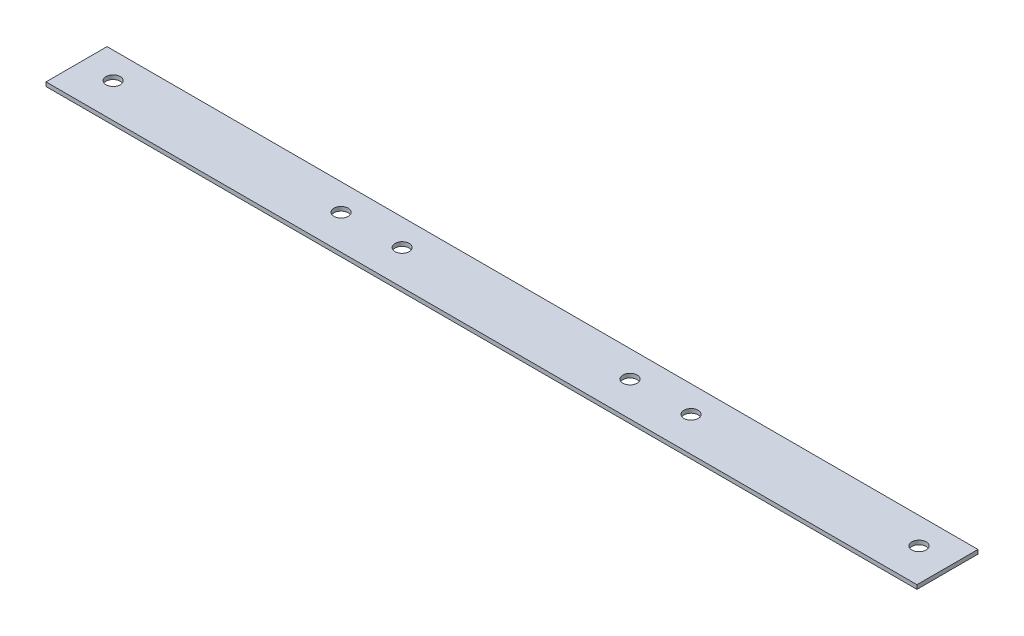
ISO-10303-21;
HEADER;
FILE_DESCRIPTION(('STEP AP214'),'2;1');
FILE_NAME('part.step','',(''),(''),'','','');
FILE_SCHEMA(('AUTOMOTIVE_DESIGN { 1 0 10303 214 1 1 1 1 }'));
ENDSEC;
DATA;
#1=APPLICATION_CONTEXT('core data for automotive mechanical design processes');
#2=APPLICATION_PROTOCOL_DEFINITION('international standard','automotive_design',2000,#1);
#3=PRODUCT_CONTEXT('',#1,'mechanical');
#4=PRODUCT('Part','Part','',(#3));
#5=PRODUCT_RELATED_PRODUCT_CATEGORY('part','',(#4));
#6=PRODUCT_DEFINITION_FORMATION('','',#4);
#7=PRODUCT_DEFINITION_CONTEXT('part definition',#1,'design');
#8=PRODUCT_DEFINITION('design','',#6,#7);
#9=PRODUCT_DEFINITION_SHAPE('','',#8);
#10=(LENGTH_UNIT() NAMED_UNIT(*) SI_UNIT(.MILLI.,.METRE.));
#11=(NAMED_UNIT(*) PLANE_ANGLE_UNIT() SI_UNIT($,.RADIAN.));
#12=(NAMED_UNIT(*) SI_UNIT($,.STERADIAN.) SOLID_ANGLE_UNIT());
#13=UNCERTAINTY_MEASURE_WITH_UNIT(LENGTH_MEASURE(1.E-05),#10,'distance_accuracy_value','');
#14=(GEOMETRIC_REPRESENTATION_CONTEXT(3) GLOBAL_UNCERTAINTY_ASSIGNED_CONTEXT((#13)) GLOBAL_UNIT_ASSIGNED_CONTEXT((#10,
#11,#12)) REPRESENTATION_CONTEXT('',''));
#15=CARTESIAN_POINT('',(0.,0.,0.));
#16=DIRECTION('',(0.,0.,1.));
#17=DIRECTION('',(1.,0.,0.));
#18=AXIS2_PLACEMENT_3D('',#15,#16,#17);
#19=CARTESIAN_POINT('',(0.,1.,0.));
#20=DIRECTION('',(0.,-1.,0.));
#21=DIRECTION('',(0.,0.,-1.));
#22=AXIS2_PLACEMENT_3D('',#19,#20,#21);
#23=PLANE('',#22);
#24=DIRECTION('',(0.,0.,1.));
#25=VECTOR('',#24,1.);
#26=CARTESIAN_POINT('',(0.,1.,0.));
#27=LINE('',#26,#25);
#28=CARTESIAN_POINT('',(0.,1.,-15.));
#29=VERTEX_POINT('',#28);
#30=CARTESIAN_POINT('',(0.,1.,0.));
#31=VERTEX_POINT('',#30);
#32=EDGE_CURVE('E86',#29,#31,#27,.T.);
#33=ORIENTED_EDGE('',*,*,#32,.T.);
#34=DIRECTION('',(1.,0.,0.));
#35=VECTOR('',#34,1.);
#36=CARTESIAN_POINT('',(0.,1.,0.));
#37=LINE('',#36,#35);
#38=CARTESIAN_POINT('',(214.,1.,0.));
#39=VERTEX_POINT('',#38);
#40=EDGE_CURVE('E81',#31,#39,#37,.T.);
#41=ORIENTED_EDGE('',*,*,#40,.T.);
#42=DIRECTION('',(0.,0.,-1.));
#43=VECTOR('',#42,1.);
#44=CARTESIAN_POINT('',(214.,1.,0.));
#45=LINE('',#44,#43);
#46=CARTESIAN_POINT('',(214.,1.,-15.));
#47=VERTEX_POINT('',#46);
#48=EDGE_CURVE('E84',#39,#47,#45,.T.);
#49=ORIENTED_EDGE('',*,*,#48,.T.);
#50=DIRECTION('',(-1.,0.,0.));
#51=VECTOR('',#50,1.);
#52=CARTESIAN_POINT('',(0.,1.,-15.));
#53=LINE('',#52,#51);
#54=EDGE_CURVE('E51',#47,#29,#53,.T.);
#55=ORIENTED_EDGE('',*,*,#54,.T.);
#56=EDGE_LOOP('',(#33,#41,#49,#55));
#57=FACE_BOUND('',#56,.T.);
#58=CARTESIAN_POINT('',(7.99999999999993,1.,-8.50000000000009));
#59=DIRECTION('',(0.,1.,0.));
#60=DIRECTION('',(0.,0.,1.));
#61=AXIS2_PLACEMENT_3D('',#58,#59,#60);
#62=CIRCLE('',#61,1.75);
#63=CARTESIAN_POINT('',(7.99999999999993,1.,-6.75000000000009));
#64=VERTEX_POINT('',#63);
#65=EDGE_CURVE('E101',#64,#64,#62,.T.);
#66=ORIENTED_EDGE('',*,*,#65,.F.);
#67=EDGE_LOOP('',(#66));
#68=FACE_BOUND('',#67,.T.);
#69=CARTESIAN_POINT('',(64.,1.,-8.5));
#70=DIRECTION('',(0.,1.,0.));
#71=DIRECTION('',(0.,0.,1.));
#72=AXIS2_PLACEMENT_3D('',#69,#70,#71);
#73=CIRCLE('',#72,1.75);
#74=CARTESIAN_POINT('',(64.,1.,-6.75));
#75=VERTEX_POINT('',#74);
#76=EDGE_CURVE('E116',#75,#75,#73,.T.);
#77=ORIENTED_EDGE('',*,*,#76,.F.);
#78=EDGE_LOOP('',(#77));
#79=FACE_BOUND('',#78,.T.);
#80=CARTESIAN_POINT('',(78.9999999999999,1.,-8.50000000000009));
#81=DIRECTION('',(0.,1.,0.));
#82=DIRECTION('',(0.,0.,1.));
#83=AXIS2_PLACEMENT_3D('',#80,#81,#82);
#84=CIRCLE('',#83,1.75);
#85=CARTESIAN_POINT('',(78.9999999999999,1.,-6.7500000000001));
#86=VERTEX_POINT('',#85);
#87=EDGE_CURVE('E122',#86,#86,#84,.T.);
#88=ORIENTED_EDGE('',*,*,#87,.F.);
#89=EDGE_LOOP('',(#88));
#90=FACE_BOUND('',#89,.T.);
#91=CARTESIAN_POINT('',(135.,1.,-8.5));
#92=DIRECTION('',(0.,1.,0.));
#93=DIRECTION('',(0.,0.,1.));
#94=AXIS2_PLACEMENT_3D('',#91,#92,#93);
#95=CIRCLE('',#94,1.74999999999998);
#96=CARTESIAN_POINT('',(135.,1.,-6.75000000000002));
#97=VERTEX_POINT('',#96);
#98=EDGE_CURVE('E128',#97,#97,#95,.T.);
#99=ORIENTED_EDGE('',*,*,#98,.F.);
#100=EDGE_LOOP('',(#99));
#101=FACE_BOUND('',#100,.T.);
#102=CARTESIAN_POINT('',(150.,1.,-8.50000000000009));
#103=DIRECTION('',(0.,1.,0.));
#104=DIRECTION('',(0.,0.,1.));
#105=AXIS2_PLACEMENT_3D('',#102,#103,#104);
#106=CIRCLE('',#105,1.75000000000001);
#107=CARTESIAN_POINT('',(150.,1.,-6.75000000000008));
#108=VERTEX_POINT('',#107);
#109=EDGE_CURVE('E134',#108,#108,#106,.T.);
#110=ORIENTED_EDGE('',*,*,#109,.F.);
#111=EDGE_LOOP('',(#110));
#112=FACE_BOUND('',#111,.T.);
#113=CARTESIAN_POINT('',(206.,1.,-8.5));
#114=DIRECTION('',(0.,1.,0.));
#115=DIRECTION('',(0.,0.,1.));
#116=AXIS2_PLACEMENT_3D('',#113,#114,#115);
#117=CIRCLE('',#116,1.75000000000001);
#118=CARTESIAN_POINT('',(206.,1.,-6.74999999999999));
#119=VERTEX_POINT('',#118);
#120=EDGE_CURVE('E140',#119,#119,#117,.T.);
#121=ORIENTED_EDGE('',*,*,#120,.F.);
#122=EDGE_LOOP('',(#121));
#123=FACE_BOUND('',#122,.T.);
#124=ADVANCED_FACE('F34',(#57,#68,#79,#90,#101,#112,#123),#23,.F.);
#125=CARTESIAN_POINT('',(0.,0.,0.));
#126=DIRECTION('',(0.,-1.,0.));
#127=DIRECTION('',(0.,0.,-1.));
#128=AXIS2_PLACEMENT_3D('',#125,#126,#127);
#129=PLANE('',#128);
#130=CARTESIAN_POINT('',(150.,0.,-8.50000000000009));
#131=DIRECTION('',(0.,1.,0.));
#132=DIRECTION('',(0.,0.,1.));
#133=AXIS2_PLACEMENT_3D('',#130,#131,#132);
#134=CIRCLE('',#133,1.75000000000001);
#135=CARTESIAN_POINT('',(150.,0.,-6.75000000000008));
#136=VERTEX_POINT('',#135);
#137=EDGE_CURVE('E137',#136,#136,#134,.T.);
#138=ORIENTED_EDGE('',*,*,#137,.T.);
#139=EDGE_LOOP('',(#138));
#140=FACE_BOUND('',#139,.T.);
#141=CARTESIAN_POINT('',(78.9999999999999,0.,-8.50000000000009));
#142=DIRECTION('',(0.,1.,0.));
#143=DIRECTION('',(0.,0.,1.));
#144=AXIS2_PLACEMENT_3D('',#141,#142,#143);
#145=CIRCLE('',#144,1.75);
#146=CARTESIAN_POINT('',(78.9999999999999,0.,-6.7500000000001));
#147=VERTEX_POINT('',#146);
#148=EDGE_CURVE('E125',#147,#147,#145,.T.);
#149=ORIENTED_EDGE('',*,*,#148,.T.);
#150=EDGE_LOOP('',(#149));
#151=FACE_BOUND('',#150,.T.);
#152=CARTESIAN_POINT('',(7.99999999999993,0.,-8.50000000000009));
#153=DIRECTION('',(0.,1.,0.));
#154=DIRECTION('',(0.,0.,1.));
#155=AXIS2_PLACEMENT_3D('',#152,#153,#154);
#156=CIRCLE('',#155,1.75);
#157=CARTESIAN_POINT('',(7.99999999999993,0.,-6.75000000000009));
#158=VERTEX_POINT('',#157);
#159=EDGE_CURVE('E113',#158,#158,#156,.T.);
#160=ORIENTED_EDGE('',*,*,#159,.T.);
#161=EDGE_LOOP('',(#160));
#162=FACE_BOUND('',#161,.T.);
#163=DIRECTION('',(0.,0.,1.));
#164=VECTOR('',#163,1.);
#165=CARTESIAN_POINT('',(0.,0.,0.));
#166=LINE('',#165,#164);
#167=CARTESIAN_POINT('',(0.,0.,-15.));
#168=VERTEX_POINT('',#167);
#169=CARTESIAN_POINT('',(0.,0.,0.));
#170=VERTEX_POINT('',#169);
#171=EDGE_CURVE('E98',#168,#170,#166,.T.);
#172=ORIENTED_EDGE('',*,*,#171,.F.);
#173=DIRECTION('',(-1.,0.,0.));
#174=VECTOR('',#173,1.);
#175=CARTESIAN_POINT('',(0.,0.,-15.));
#176=LINE('',#175,#174);
#177=CARTESIAN_POINT('',(214.,0.,-15.));
#178=VERTEX_POINT('',#177);
#179=EDGE_CURVE('E74',#178,#168,#176,.T.);
#180=ORIENTED_EDGE('',*,*,#179,.F.);
#181=DIRECTION('',(0.,0.,-1.));
#182=VECTOR('',#181,1.);
#183=CARTESIAN_POINT('',(214.,0.,0.));
#184=LINE('',#183,#182);
#185=CARTESIAN_POINT('',(214.,0.,0.));
#186=VERTEX_POINT('',#185);
#187=EDGE_CURVE('E68',#186,#178,#184,.T.);
#188=ORIENTED_EDGE('',*,*,#187,.F.);
#189=DIRECTION('',(1.,0.,0.));
#190=VECTOR('',#189,1.);
#191=CARTESIAN_POINT('',(0.,0.,0.));
#192=LINE('',#191,#190);
#193=EDGE_CURVE('E90',#170,#186,#192,.T.);
#194=ORIENTED_EDGE('',*,*,#193,.F.);
#195=EDGE_LOOP('',(#172,#180,#188,#194));
#196=FACE_BOUND('',#195,.T.);
#197=CARTESIAN_POINT('',(64.,0.,-8.5));
#198=DIRECTION('',(0.,1.,0.));
#199=DIRECTION('',(0.,0.,1.));
#200=AXIS2_PLACEMENT_3D('',#197,#198,#199);
#201=CIRCLE('',#200,1.75);
#202=CARTESIAN_POINT('',(64.,0.,-6.75));
#203=VERTEX_POINT('',#202);
#204=EDGE_CURVE('E119',#203,#203,#201,.T.);
#205=ORIENTED_EDGE('',*,*,#204,.T.);
#206=EDGE_LOOP('',(#205));
#207=FACE_BOUND('',#206,.T.);
#208=CARTESIAN_POINT('',(135.,0.,-8.5));
#209=DIRECTION('',(0.,1.,0.));
#210=DIRECTION('',(0.,0.,1.));
#211=AXIS2_PLACEMENT_3D('',#208,#209,#210);
#212=CIRCLE('',#211,1.74999999999998);
#213=CARTESIAN_POINT('',(135.,0.,-6.75000000000002));
#214=VERTEX_POINT('',#213);
#215=EDGE_CURVE('E131',#214,#214,#212,.T.);
#216=ORIENTED_EDGE('',*,*,#215,.T.);
#217=EDGE_LOOP('',(#216));
#218=FACE_BOUND('',#217,.T.);
#219=CARTESIAN_POINT('',(206.,0.,-8.5));
#220=DIRECTION('',(0.,1.,0.));
#221=DIRECTION('',(0.,0.,1.));
#222=AXIS2_PLACEMENT_3D('',#219,#220,#221);
#223=CIRCLE('',#222,1.75000000000001);
#224=CARTESIAN_POINT('',(206.,0.,-6.74999999999999));
#225=VERTEX_POINT('',#224);
#226=EDGE_CURVE('E143',#225,#225,#223,.T.);
#227=ORIENTED_EDGE('',*,*,#226,.T.);
#228=EDGE_LOOP('',(#227));
#229=FACE_BOUND('',#228,.T.);
#230=ADVANCED_FACE('F109',(#140,#151,#162,#196,#207,#218,#229),#129,.T.);
#231=CARTESIAN_POINT('',(0.,1.,0.));
#232=DIRECTION('',(1.,0.,0.));
#233=DIRECTION('',(0.,0.,-1.));
#234=AXIS2_PLACEMENT_3D('',#231,#232,#233);
#235=PLANE('',#234);
#236=ORIENTED_EDGE('',*,*,#171,.T.);
#237=DIRECTION('',(0.,-1.,0.));
#238=VECTOR('',#237,1.);
#239=CARTESIAN_POINT('',(0.,1.,0.));
#240=LINE('',#239,#238);
#241=EDGE_CURVE('E11',#31,#170,#240,.T.);
#242=ORIENTED_EDGE('',*,*,#241,.F.);
#243=ORIENTED_EDGE('',*,*,#32,.F.);
#244=DIRECTION('',(0.,-1.,0.));
#245=VECTOR('',#244,1.);
#246=CARTESIAN_POINT('',(0.,1.,-15.));
#247=LINE('',#246,#245);
#248=EDGE_CURVE('E94',#29,#168,#247,.T.);
#249=ORIENTED_EDGE('',*,*,#248,.T.);
#250=EDGE_LOOP('',(#236,#242,#243,#249));
#251=FACE_BOUND('',#250,.T.);
#252=ADVANCED_FACE('F36',(#251),#235,.F.);
#253=CARTESIAN_POINT('',(0.,1.,0.));
#254=DIRECTION('',(0.,0.,-1.));
#255=DIRECTION('',(-1.,0.,0.));
#256=AXIS2_PLACEMENT_3D('',#253,#254,#255);
#257=PLANE('',#256);
#258=ORIENTED_EDGE('',*,*,#193,.T.);
#259=DIRECTION('',(0.,-1.,0.));
#260=VECTOR('',#259,1.);
#261=CARTESIAN_POINT('',(214.,1.,0.));
#262=LINE('',#261,#260);
#263=EDGE_CURVE('E43',#39,#186,#262,.T.);
#264=ORIENTED_EDGE('',*,*,#263,.F.);
#265=ORIENTED_EDGE('',*,*,#40,.F.);
#266=ORIENTED_EDGE('',*,*,#241,.T.);
#267=EDGE_LOOP('',(#258,#264,#265,#266));
#268=FACE_BOUND('',#267,.T.);
#269=ADVANCED_FACE('F89',(#268),#257,.F.);
#270=CARTESIAN_POINT('',(214.,1.,0.));
#271=DIRECTION('',(-1.,0.,0.));
#272=DIRECTION('',(0.,0.,1.));
#273=AXIS2_PLACEMENT_3D('',#270,#271,#272);
#274=PLANE('',#273);
#275=ORIENTED_EDGE('',*,*,#187,.T.);
#276=DIRECTION('',(0.,-1.,0.));
#277=VECTOR('',#276,1.);
#278=CARTESIAN_POINT('',(214.,1.,-15.));
#279=LINE('',#278,#277);
#280=EDGE_CURVE('E91',#47,#178,#279,.T.);
#281=ORIENTED_EDGE('',*,*,#280,.F.);
#282=ORIENTED_EDGE('',*,*,#48,.F.);
#283=ORIENTED_EDGE('',*,*,#263,.T.);
#284=EDGE_LOOP('',(#275,#281,#282,#283));
#285=FACE_BOUND('',#284,.T.);
#286=ADVANCED_FACE('F92',(#285),#274,.F.);
#287=CARTESIAN_POINT('',(0.,1.,-15.));
#288=DIRECTION('',(0.,0.,1.));
#289=DIRECTION('',(1.,0.,0.));
#290=AXIS2_PLACEMENT_3D('',#287,#288,#289);
#291=PLANE('',#290);
#292=ORIENTED_EDGE('',*,*,#179,.T.);
#293=ORIENTED_EDGE('',*,*,#248,.F.);
#294=ORIENTED_EDGE('',*,*,#54,.F.);
#295=ORIENTED_EDGE('',*,*,#280,.T.);
#296=EDGE_LOOP('',(#292,#293,#294,#295));
#297=FACE_BOUND('',#296,.T.);
#298=ADVANCED_FACE('F106',(#297),#291,.F.);
#299=CARTESIAN_POINT('',(7.99999999999993,1.,-8.50000000000009));
#300=DIRECTION('',(0.,-1.,0.));
#301=DIRECTION('',(0.,0.,-1.));
#302=AXIS2_PLACEMENT_3D('',#299,#300,#301);
#303=CYLINDRICAL_SURFACE('',#302,1.75);
#304=ORIENTED_EDGE('',*,*,#65,.T.);
#305=EDGE_LOOP('',(#304));
#306=FACE_BOUND('',#305,.T.);
#307=ORIENTED_EDGE('',*,*,#159,.F.);
#308=EDGE_LOOP('',(#307));
#309=FACE_BOUND('',#308,.T.);
#310=ADVANCED_FACE('F160',(#306,#309),#303,.F.);
#311=CARTESIAN_POINT('',(64.,1.,-8.5));
#312=DIRECTION('',(0.,-1.,0.));
#313=DIRECTION('',(0.,0.,-1.));
#314=AXIS2_PLACEMENT_3D('',#311,#312,#313);
#315=CYLINDRICAL_SURFACE('',#314,1.75);
#316=ORIENTED_EDGE('',*,*,#76,.T.);
#317=EDGE_LOOP('',(#316));
#318=FACE_BOUND('',#317,.T.);
#319=ORIENTED_EDGE('',*,*,#204,.F.);
#320=EDGE_LOOP('',(#319));
#321=FACE_BOUND('',#320,.T.);
#322=ADVANCED_FACE('F206',(#318,#321),#315,.F.);
#323=CARTESIAN_POINT('',(78.9999999999999,1.,-8.50000000000009));
#324=DIRECTION('',(0.,-1.,0.));
#325=DIRECTION('',(0.,0.,-1.));
#326=AXIS2_PLACEMENT_3D('',#323,#324,#325);
#327=CYLINDRICAL_SURFACE('',#326,1.75);
#328=ORIENTED_EDGE('',*,*,#87,.T.);
#329=EDGE_LOOP('',(#328));
#330=FACE_BOUND('',#329,.T.);
#331=ORIENTED_EDGE('',*,*,#148,.F.);
#332=EDGE_LOOP('',(#331));
#333=FACE_BOUND('',#332,.T.);
#334=ADVANCED_FACE('F214',(#330,#333),#327,.F.);
#335=CARTESIAN_POINT('',(135.,1.,-8.5));
#336=DIRECTION('',(0.,-1.,0.));
#337=DIRECTION('',(0.,0.,-1.));
#338=AXIS2_PLACEMENT_3D('',#335,#336,#337);
#339=CYLINDRICAL_SURFACE('',#338,1.74999999999998);
#340=ORIENTED_EDGE('',*,*,#98,.T.);
#341=EDGE_LOOP('',(#340));
#342=FACE_BOUND('',#341,.T.);
#343=ORIENTED_EDGE('',*,*,#215,.F.);
#344=EDGE_LOOP('',(#343));
#345=FACE_BOUND('',#344,.T.);
#346=ADVANCED_FACE('F222',(#342,#345),#339,.F.);
#347=CARTESIAN_POINT('',(150.,1.,-8.50000000000009));
#348=DIRECTION('',(0.,-1.,0.));
#349=DIRECTION('',(0.,0.,-1.));
#350=AXIS2_PLACEMENT_3D('',#347,#348,#349);
#351=CYLINDRICAL_SURFACE('',#350,1.75000000000001);
#352=ORIENTED_EDGE('',*,*,#109,.T.);
#353=EDGE_LOOP('',(#352));
#354=FACE_BOUND('',#353,.T.);
#355=ORIENTED_EDGE('',*,*,#137,.F.);
#356=EDGE_LOOP('',(#355));
#357=FACE_BOUND('',#356,.T.);
#358=ADVANCED_FACE('F231',(#354,#357),#351,.F.);
#359=CARTESIAN_POINT('',(206.,1.,-8.5));
#360=DIRECTION('',(0.,-1.,0.));
#361=DIRECTION('',(0.,0.,-1.));
#362=AXIS2_PLACEMENT_3D('',#359,#360,#361);
#363=CYLINDRICAL_SURFACE('',#362,1.75000000000001);
#364=ORIENTED_EDGE('',*,*,#120,.T.);
#365=EDGE_LOOP('',(#364));
#366=FACE_BOUND('',#365,.T.);
#367=ORIENTED_EDGE('',*,*,#226,.F.);
#368=EDGE_LOOP('',(#367));
#369=FACE_BOUND('',#368,.T.);
#370=ADVANCED_FACE('F149',(#366,#369),#363,.F.);
#371=CLOSED_SHELL('',(#124,#230,#252,#269,#286,#298,#310,#322,#334,#346,#358,#370));
#372=MANIFOLD_SOLID_BREP('B2',#371);
#373=ADVANCED_BREP_SHAPE_REPRESENTATION('',(#18,#372),#14);
#374=SHAPE_DEFINITION_REPRESENTATION(#9,#373);
ENDSEC;
END-ISO-10303-21;
